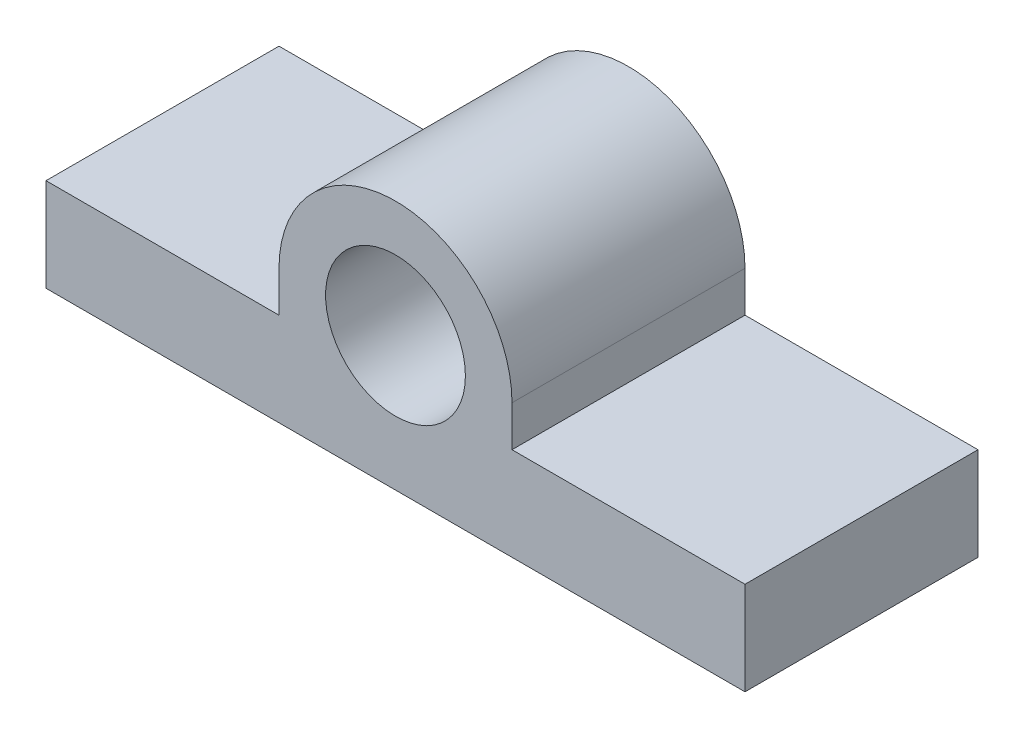
ISO-10303-21;
HEADER;
FILE_DESCRIPTION(('STEP AP214'),'2;1');
FILE_NAME('part.step','',(''),(''),'','','');
FILE_SCHEMA(('AUTOMOTIVE_DESIGN { 1 0 10303 214 1 1 1 1 }'));
ENDSEC;
DATA;
#1=APPLICATION_CONTEXT('core data for automotive mechanical design processes');
#2=APPLICATION_PROTOCOL_DEFINITION('international standard','automotive_design',2000,#1);
#3=PRODUCT_CONTEXT('',#1,'mechanical');
#4=PRODUCT('Part','Part','',(#3));
#5=PRODUCT_RELATED_PRODUCT_CATEGORY('part','',(#4));
#6=PRODUCT_DEFINITION_FORMATION('','',#4);
#7=PRODUCT_DEFINITION_CONTEXT('part definition',#1,'design');
#8=PRODUCT_DEFINITION('design','',#6,#7);
#9=PRODUCT_DEFINITION_SHAPE('','',#8);
#10=(LENGTH_UNIT() NAMED_UNIT(*) SI_UNIT(.MILLI.,.METRE.));
#11=(NAMED_UNIT(*) PLANE_ANGLE_UNIT() SI_UNIT($,.RADIAN.));
#12=(NAMED_UNIT(*) SI_UNIT($,.STERADIAN.) SOLID_ANGLE_UNIT());
#13=UNCERTAINTY_MEASURE_WITH_UNIT(LENGTH_MEASURE(1.E-05),#10,'distance_accuracy_value','');
#14=(GEOMETRIC_REPRESENTATION_CONTEXT(3) GLOBAL_UNCERTAINTY_ASSIGNED_CONTEXT((#13)) GLOBAL_UNIT_ASSIGNED_CONTEXT((#10,
#11,#12)) REPRESENTATION_CONTEXT('',''));
#15=CARTESIAN_POINT('',(0.,0.,0.));
#16=DIRECTION('',(0.,0.,1.));
#17=DIRECTION('',(1.,0.,0.));
#18=AXIS2_PLACEMENT_3D('',#15,#16,#17);
#19=CARTESIAN_POINT('',(-2.05285153677481,1.68609542140847,12.7));
#20=DIRECTION('',(0.,0.,1.));
#21=DIRECTION('',(1.,0.,0.));
#22=AXIS2_PLACEMENT_3D('',#19,#20,#21);
#23=PLANE('',#22);
#24=CARTESIAN_POINT('',(-2.05285153677481,1.68609542140847,12.7));
#25=DIRECTION('',(0.,0.,1.));
#26=DIRECTION('',(1.,0.,0.));
#27=AXIS2_PLACEMENT_3D('',#24,#25,#26);
#28=CIRCLE('',#27,6.35);
#29=CARTESIAN_POINT('',(4.29714846322519,1.68609542140847,12.7));
#30=VERTEX_POINT('',#29);
#31=CARTESIAN_POINT('',(-8.40285153677481,1.68609542140843,12.7));
#32=VERTEX_POINT('',#31);
#33=EDGE_CURVE('E168',#30,#32,#28,.T.);
#34=ORIENTED_EDGE('',*,*,#33,.T.);
#35=DIRECTION('',(0.,-1.,0.));
#36=VECTOR('',#35,1.);
#37=CARTESIAN_POINT('',(-8.40285153677481,1.68609542140843,12.7));
#38=LINE('',#37,#36);
#39=CARTESIAN_POINT('',(-8.40285153677481,-0.529390311918768,12.7));
#40=VERTEX_POINT('',#39);
#41=EDGE_CURVE('E104',#32,#40,#38,.T.);
#42=ORIENTED_EDGE('',*,*,#41,.T.);
#43=DIRECTION('',(-1.,0.,0.));
#44=VECTOR('',#43,1.);
#45=CARTESIAN_POINT('',(-21.1028515367748,-0.529390311918764,12.7));
#46=LINE('',#45,#44);
#47=CARTESIAN_POINT('',(-21.1028515367748,-0.529390311918764,12.7));
#48=VERTEX_POINT('',#47);
#49=EDGE_CURVE('E189',#40,#48,#46,.T.);
#50=ORIENTED_EDGE('',*,*,#49,.T.);
#51=DIRECTION('',(0.,-1.,0.));
#52=VECTOR('',#51,1.);
#53=CARTESIAN_POINT('',(-21.1028515367748,-0.529390311918764,12.7));
#54=LINE('',#53,#52);
#55=CARTESIAN_POINT('',(-21.1028515367748,-5.60939031191876,12.7));
#56=VERTEX_POINT('',#55);
#57=EDGE_CURVE('E203',#48,#56,#54,.T.);
#58=ORIENTED_EDGE('',*,*,#57,.T.);
#59=DIRECTION('',(1.,0.,0.));
#60=VECTOR('',#59,1.);
#61=CARTESIAN_POINT('',(-21.1028515367748,-5.60939031191876,12.7));
#62=LINE('',#61,#60);
#63=CARTESIAN_POINT('',(16.9971484632252,-5.60939031191876,12.7));
#64=VERTEX_POINT('',#63);
#65=EDGE_CURVE('E123',#56,#64,#62,.T.);
#66=ORIENTED_EDGE('',*,*,#65,.T.);
#67=DIRECTION('',(0.,1.,0.));
#68=VECTOR('',#67,1.);
#69=CARTESIAN_POINT('',(16.9971484632252,-0.529390311918765,12.7));
#70=LINE('',#69,#68);
#71=CARTESIAN_POINT('',(16.9971484632252,-0.529390311918765,12.7));
#72=VERTEX_POINT('',#71);
#73=EDGE_CURVE('E117',#64,#72,#70,.T.);
#74=ORIENTED_EDGE('',*,*,#73,.T.);
#75=DIRECTION('',(-1.,0.,0.));
#76=VECTOR('',#75,1.);
#77=CARTESIAN_POINT('',(16.9971484632252,-0.529390311918765,12.7));
#78=LINE('',#77,#76);
#79=CARTESIAN_POINT('',(4.29714846322519,-0.529390311918768,12.7));
#80=VERTEX_POINT('',#79);
#81=EDGE_CURVE('E121',#72,#80,#78,.T.);
#82=ORIENTED_EDGE('',*,*,#81,.T.);
#83=DIRECTION('',(0.,1.,0.));
#84=VECTOR('',#83,1.);
#85=CARTESIAN_POINT('',(4.29714846322519,1.68609542140847,12.7));
#86=LINE('',#85,#84);
#87=EDGE_CURVE('E61',#80,#30,#86,.T.);
#88=ORIENTED_EDGE('',*,*,#87,.T.);
#89=EDGE_LOOP('',(#34,#42,#50,#58,#66,#74,#82,#88));
#90=FACE_BOUND('',#89,.T.);
#91=CARTESIAN_POINT('',(-2.05285153677481,1.68609542140847,12.7));
#92=DIRECTION('',(0.,0.,1.));
#93=DIRECTION('',(1.,0.,0.));
#94=AXIS2_PLACEMENT_3D('',#91,#92,#93);
#95=CIRCLE('',#94,3.81);
#96=CARTESIAN_POINT('',(1.75714846322519,1.68609542140847,12.7));
#97=VERTEX_POINT('',#96);
#98=EDGE_CURVE('E150',#97,#97,#95,.T.);
#99=ORIENTED_EDGE('',*,*,#98,.F.);
#100=EDGE_LOOP('',(#99));
#101=FACE_BOUND('',#100,.T.);
#102=ADVANCED_FACE('F43',(#90,#101),#23,.T.);
#103=CARTESIAN_POINT('',(-2.05285153677481,1.68609542140847,0.));
#104=DIRECTION('',(0.,0.,1.));
#105=DIRECTION('',(1.,0.,0.));
#106=AXIS2_PLACEMENT_3D('',#103,#104,#105);
#107=PLANE('',#106);
#108=CARTESIAN_POINT('',(-2.05285153677481,1.68609542140847,0.));
#109=DIRECTION('',(0.,0.,1.));
#110=DIRECTION('',(1.,0.,0.));
#111=AXIS2_PLACEMENT_3D('',#108,#109,#110);
#112=CIRCLE('',#111,6.35);
#113=CARTESIAN_POINT('',(4.29714846322519,1.68609542140847,0.));
#114=VERTEX_POINT('',#113);
#115=CARTESIAN_POINT('',(-8.40285153677481,1.68609542140843,0.));
#116=VERTEX_POINT('',#115);
#117=EDGE_CURVE('E145',#114,#116,#112,.T.);
#118=ORIENTED_EDGE('',*,*,#117,.F.);
#119=DIRECTION('',(0.,1.,0.));
#120=VECTOR('',#119,1.);
#121=CARTESIAN_POINT('',(4.29714846322519,1.68609542140847,0.));
#122=LINE('',#121,#120);
#123=CARTESIAN_POINT('',(4.29714846322519,-0.529390311918768,0.));
#124=VERTEX_POINT('',#123);
#125=EDGE_CURVE('E96',#124,#114,#122,.T.);
#126=ORIENTED_EDGE('',*,*,#125,.F.);
#127=DIRECTION('',(-1.,0.,0.));
#128=VECTOR('',#127,1.);
#129=CARTESIAN_POINT('',(16.9971484632252,-0.529390311918765,0.));
#130=LINE('',#129,#128);
#131=CARTESIAN_POINT('',(16.9971484632252,-0.529390311918765,0.));
#132=VERTEX_POINT('',#131);
#133=EDGE_CURVE('E90',#132,#124,#130,.T.);
#134=ORIENTED_EDGE('',*,*,#133,.F.);
#135=DIRECTION('',(0.,1.,0.));
#136=VECTOR('',#135,1.);
#137=CARTESIAN_POINT('',(16.9971484632252,-0.529390311918765,0.));
#138=LINE('',#137,#136);
#139=CARTESIAN_POINT('',(16.9971484632252,-5.60939031191876,0.));
#140=VERTEX_POINT('',#139);
#141=EDGE_CURVE('E132',#140,#132,#138,.T.);
#142=ORIENTED_EDGE('',*,*,#141,.F.);
#143=DIRECTION('',(1.,0.,0.));
#144=VECTOR('',#143,1.);
#145=CARTESIAN_POINT('',(-21.1028515367748,-5.60939031191876,0.));
#146=LINE('',#145,#144);
#147=CARTESIAN_POINT('',(-21.1028515367748,-5.60939031191876,0.));
#148=VERTEX_POINT('',#147);
#149=EDGE_CURVE('E159',#148,#140,#146,.T.);
#150=ORIENTED_EDGE('',*,*,#149,.F.);
#151=DIRECTION('',(0.,-1.,0.));
#152=VECTOR('',#151,1.);
#153=CARTESIAN_POINT('',(-21.1028515367748,-0.529390311918764,0.));
#154=LINE('',#153,#152);
#155=CARTESIAN_POINT('',(-21.1028515367748,-0.529390311918764,0.));
#156=VERTEX_POINT('',#155);
#157=EDGE_CURVE('E156',#156,#148,#154,.T.);
#158=ORIENTED_EDGE('',*,*,#157,.F.);
#159=DIRECTION('',(-1.,0.,0.));
#160=VECTOR('',#159,1.);
#161=CARTESIAN_POINT('',(-21.1028515367748,-0.529390311918764,0.));
#162=LINE('',#161,#160);
#163=CARTESIAN_POINT('',(-8.40285153677481,-0.529390311918768,0.));
#164=VERTEX_POINT('',#163);
#165=EDGE_CURVE('E153',#164,#156,#162,.T.);
#166=ORIENTED_EDGE('',*,*,#165,.F.);
#167=DIRECTION('',(0.,-1.,0.));
#168=VECTOR('',#167,1.);
#169=CARTESIAN_POINT('',(-8.40285153677481,1.68609542140843,0.));
#170=LINE('',#169,#168);
#171=EDGE_CURVE('E149',#116,#164,#170,.T.);
#172=ORIENTED_EDGE('',*,*,#171,.F.);
#173=EDGE_LOOP('',(#118,#126,#134,#142,#150,#158,#166,#172));
#174=FACE_BOUND('',#173,.T.);
#175=CARTESIAN_POINT('',(-2.05285153677481,1.68609542140847,0.));
#176=DIRECTION('',(0.,0.,1.));
#177=DIRECTION('',(1.,0.,0.));
#178=AXIS2_PLACEMENT_3D('',#175,#176,#177);
#179=CIRCLE('',#178,3.81);
#180=CARTESIAN_POINT('',(1.75714846322519,1.68609542140847,0.));
#181=VERTEX_POINT('',#180);
#182=EDGE_CURVE('E213',#181,#181,#179,.T.);
#183=ORIENTED_EDGE('',*,*,#182,.T.);
#184=EDGE_LOOP('',(#183));
#185=FACE_BOUND('',#184,.T.);
#186=ADVANCED_FACE('F193',(#174,#185),#107,.F.);
#187=CARTESIAN_POINT('',(-2.05285153677481,1.68609542140847,12.7));
#188=DIRECTION('',(0.,0.,-1.));
#189=DIRECTION('',(-1.,0.,0.));
#190=AXIS2_PLACEMENT_3D('',#187,#188,#189);
#191=CYLINDRICAL_SURFACE('',#190,6.35);
#192=ORIENTED_EDGE('',*,*,#117,.T.);
#193=DIRECTION('',(0.,0.,-1.));
#194=VECTOR('',#193,1.);
#195=CARTESIAN_POINT('',(-8.40285153677481,1.68609542140843,12.7));
#196=LINE('',#195,#194);
#197=EDGE_CURVE('E11',#32,#116,#196,.T.);
#198=ORIENTED_EDGE('',*,*,#197,.F.);
#199=ORIENTED_EDGE('',*,*,#33,.F.);
#200=DIRECTION('',(0.,0.,-1.));
#201=VECTOR('',#200,1.);
#202=CARTESIAN_POINT('',(4.29714846322519,1.68609542140847,12.7));
#203=LINE('',#202,#201);
#204=EDGE_CURVE('E141',#30,#114,#203,.T.);
#205=ORIENTED_EDGE('',*,*,#204,.T.);
#206=EDGE_LOOP('',(#192,#198,#199,#205));
#207=FACE_BOUND('',#206,.T.);
#208=ADVANCED_FACE('F45',(#207),#191,.T.);
#209=CARTESIAN_POINT('',(-8.40285153677481,1.68609542140843,12.7));
#210=DIRECTION('',(1.,0.,0.));
#211=DIRECTION('',(0.,0.,-1.));
#212=AXIS2_PLACEMENT_3D('',#209,#210,#211);
#213=PLANE('',#212);
#214=ORIENTED_EDGE('',*,*,#171,.T.);
#215=DIRECTION('',(0.,0.,-1.));
#216=VECTOR('',#215,1.);
#217=CARTESIAN_POINT('',(-8.40285153677481,-0.529390311918768,12.7));
#218=LINE('',#217,#216);
#219=EDGE_CURVE('E53',#40,#164,#218,.T.);
#220=ORIENTED_EDGE('',*,*,#219,.F.);
#221=ORIENTED_EDGE('',*,*,#41,.F.);
#222=ORIENTED_EDGE('',*,*,#197,.T.);
#223=EDGE_LOOP('',(#214,#220,#221,#222));
#224=FACE_BOUND('',#223,.T.);
#225=ADVANCED_FACE('F243',(#224),#213,.F.);
#226=CARTESIAN_POINT('',(-21.1028515367748,-0.529390311918764,12.7));
#227=DIRECTION('',(0.,-1.,0.));
#228=DIRECTION('',(1.,0.,0.));
#229=AXIS2_PLACEMENT_3D('',#226,#227,#228);
#230=PLANE('',#229);
#231=ORIENTED_EDGE('',*,*,#165,.T.);
#232=DIRECTION('',(0.,0.,-1.));
#233=VECTOR('',#232,1.);
#234=CARTESIAN_POINT('',(-21.1028515367748,-0.529390311918764,12.7));
#235=LINE('',#234,#233);
#236=EDGE_CURVE('E179',#48,#156,#235,.T.);
#237=ORIENTED_EDGE('',*,*,#236,.F.);
#238=ORIENTED_EDGE('',*,*,#49,.F.);
#239=ORIENTED_EDGE('',*,*,#219,.T.);
#240=EDGE_LOOP('',(#231,#237,#238,#239));
#241=FACE_BOUND('',#240,.T.);
#242=ADVANCED_FACE('F187',(#241),#230,.F.);
#243=CARTESIAN_POINT('',(-21.1028515367748,-0.529390311918764,12.7));
#244=DIRECTION('',(1.,0.,0.));
#245=DIRECTION('',(0.,0.,-1.));
#246=AXIS2_PLACEMENT_3D('',#243,#244,#245);
#247=PLANE('',#246);
#248=ORIENTED_EDGE('',*,*,#157,.T.);
#249=DIRECTION('',(0.,0.,-1.));
#250=VECTOR('',#249,1.);
#251=CARTESIAN_POINT('',(-21.1028515367748,-5.60939031191876,12.7));
#252=LINE('',#251,#250);
#253=EDGE_CURVE('E175',#56,#148,#252,.T.);
#254=ORIENTED_EDGE('',*,*,#253,.F.);
#255=ORIENTED_EDGE('',*,*,#57,.F.);
#256=ORIENTED_EDGE('',*,*,#236,.T.);
#257=EDGE_LOOP('',(#248,#254,#255,#256));
#258=FACE_BOUND('',#257,.T.);
#259=ADVANCED_FACE('F198',(#258),#247,.F.);
#260=CARTESIAN_POINT('',(-21.1028515367748,-5.60939031191876,12.7));
#261=DIRECTION('',(0.,1.,0.));
#262=DIRECTION('',(-1.,0.,0.));
#263=AXIS2_PLACEMENT_3D('',#260,#261,#262);
#264=PLANE('',#263);
#265=ORIENTED_EDGE('',*,*,#149,.T.);
#266=DIRECTION('',(0.,0.,-1.));
#267=VECTOR('',#266,1.);
#268=CARTESIAN_POINT('',(16.9971484632252,-5.60939031191876,12.7));
#269=LINE('',#268,#267);
#270=EDGE_CURVE('E134',#64,#140,#269,.T.);
#271=ORIENTED_EDGE('',*,*,#270,.F.);
#272=ORIENTED_EDGE('',*,*,#65,.F.);
#273=ORIENTED_EDGE('',*,*,#253,.T.);
#274=EDGE_LOOP('',(#265,#271,#272,#273));
#275=FACE_BOUND('',#274,.T.);
#276=ADVANCED_FACE('F201',(#275),#264,.F.);
#277=CARTESIAN_POINT('',(16.9971484632252,-0.529390311918765,12.7));
#278=DIRECTION('',(-1.,0.,0.));
#279=DIRECTION('',(0.,0.,1.));
#280=AXIS2_PLACEMENT_3D('',#277,#278,#279);
#281=PLANE('',#280);
#282=ORIENTED_EDGE('',*,*,#141,.T.);
#283=DIRECTION('',(0.,0.,-1.));
#284=VECTOR('',#283,1.);
#285=CARTESIAN_POINT('',(16.9971484632252,-0.529390311918765,12.7));
#286=LINE('',#285,#284);
#287=EDGE_CURVE('E129',#72,#132,#286,.T.);
#288=ORIENTED_EDGE('',*,*,#287,.F.);
#289=ORIENTED_EDGE('',*,*,#73,.F.);
#290=ORIENTED_EDGE('',*,*,#270,.T.);
#291=EDGE_LOOP('',(#282,#288,#289,#290));
#292=FACE_BOUND('',#291,.T.);
#293=ADVANCED_FACE('F130',(#292),#281,.F.);
#294=CARTESIAN_POINT('',(16.9971484632252,-0.529390311918765,12.7));
#295=DIRECTION('',(0.,-1.,0.));
#296=DIRECTION('',(1.,0.,0.));
#297=AXIS2_PLACEMENT_3D('',#294,#295,#296);
#298=PLANE('',#297);
#299=ORIENTED_EDGE('',*,*,#133,.T.);
#300=DIRECTION('',(0.,0.,-1.));
#301=VECTOR('',#300,1.);
#302=CARTESIAN_POINT('',(4.29714846322519,-0.529390311918768,12.7));
#303=LINE('',#302,#301);
#304=EDGE_CURVE('E135',#80,#124,#303,.T.);
#305=ORIENTED_EDGE('',*,*,#304,.F.);
#306=ORIENTED_EDGE('',*,*,#81,.F.);
#307=ORIENTED_EDGE('',*,*,#287,.T.);
#308=EDGE_LOOP('',(#299,#305,#306,#307));
#309=FACE_BOUND('',#308,.T.);
#310=ADVANCED_FACE('F137',(#309),#298,.F.);
#311=CARTESIAN_POINT('',(4.29714846322519,1.68609542140847,12.7));
#312=DIRECTION('',(-1.,0.,0.));
#313=DIRECTION('',(0.,-1.,0.));
#314=AXIS2_PLACEMENT_3D('',#311,#312,#313);
#315=PLANE('',#314);
#316=ORIENTED_EDGE('',*,*,#125,.T.);
#317=ORIENTED_EDGE('',*,*,#204,.F.);
#318=ORIENTED_EDGE('',*,*,#87,.F.);
#319=ORIENTED_EDGE('',*,*,#304,.T.);
#320=EDGE_LOOP('',(#316,#317,#318,#319));
#321=FACE_BOUND('',#320,.T.);
#322=ADVANCED_FACE('F231',(#321),#315,.F.);
#323=CARTESIAN_POINT('',(-2.05285153677481,1.68609542140847,12.7));
#324=DIRECTION('',(0.,0.,-1.));
#325=DIRECTION('',(-1.,0.,0.));
#326=AXIS2_PLACEMENT_3D('',#323,#324,#325);
#327=CYLINDRICAL_SURFACE('',#326,3.81);
#328=ORIENTED_EDGE('',*,*,#98,.T.);
#329=EDGE_LOOP('',(#328));
#330=FACE_BOUND('',#329,.T.);
#331=ORIENTED_EDGE('',*,*,#182,.F.);
#332=EDGE_LOOP('',(#331));
#333=FACE_BOUND('',#332,.T.);
#334=ADVANCED_FACE('F221',(#330,#333),#327,.F.);
#335=CLOSED_SHELL('',(#102,#186,#208,#225,#242,#259,#276,#293,#310,#322,#334));
#336=MANIFOLD_SOLID_BREP('B2',#335);
#337=ADVANCED_BREP_SHAPE_REPRESENTATION('',(#18,#336),#14);
#338=SHAPE_DEFINITION_REPRESENTATION(#9,#337);
ENDSEC;
END-ISO-10303-21;
